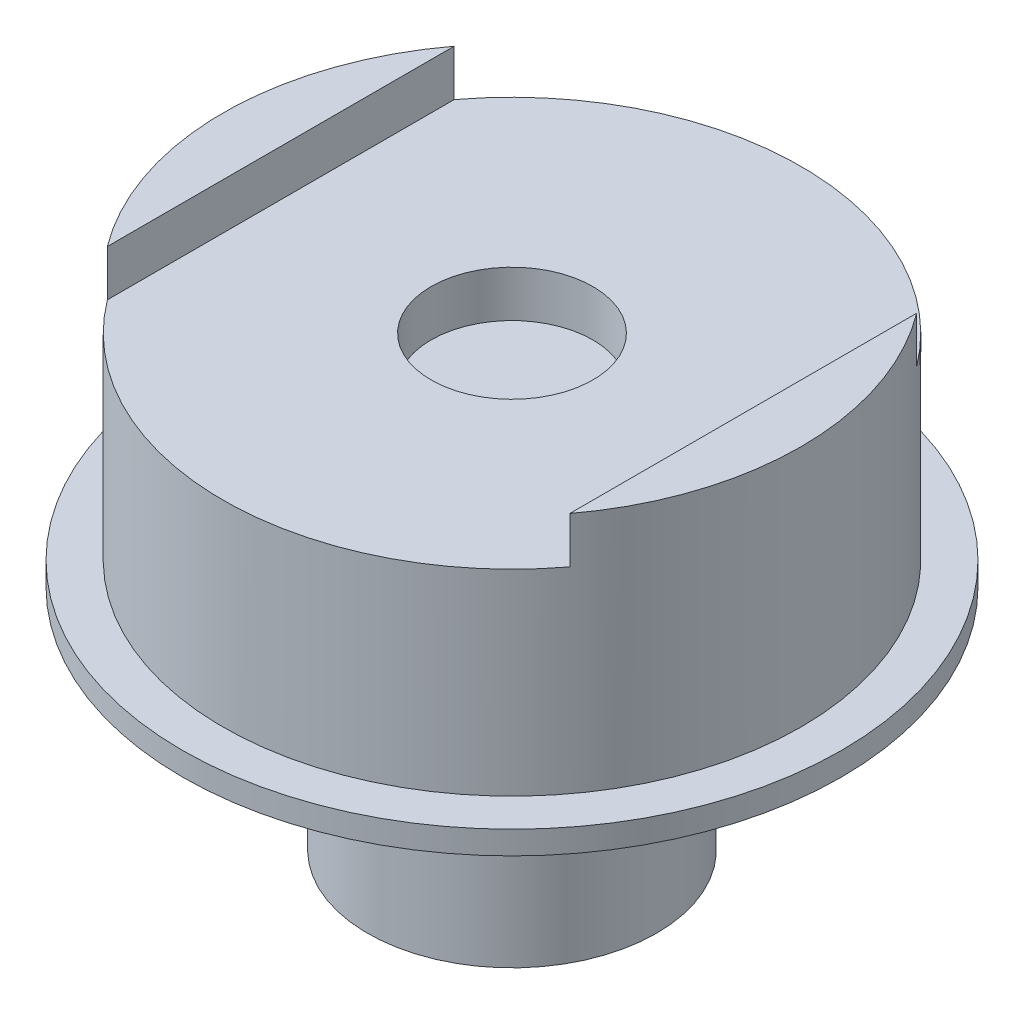
ISO-10303-21;
HEADER;
FILE_DESCRIPTION(('STEP AP214'),'2;1');
FILE_NAME('part.step','',(''),(''),'','','');
FILE_SCHEMA(('AUTOMOTIVE_DESIGN { 1 0 10303 214 1 1 1 1 }'));
ENDSEC;
DATA;
#1=APPLICATION_CONTEXT('core data for automotive mechanical design processes');
#2=APPLICATION_PROTOCOL_DEFINITION('international standard','automotive_design',2000,#1);
#3=PRODUCT_CONTEXT('',#1,'mechanical');
#4=PRODUCT('Part','Part','',(#3));
#5=PRODUCT_RELATED_PRODUCT_CATEGORY('part','',(#4));
#6=PRODUCT_DEFINITION_FORMATION('','',#4);
#7=PRODUCT_DEFINITION_CONTEXT('part definition',#1,'design');
#8=PRODUCT_DEFINITION('design','',#6,#7);
#9=PRODUCT_DEFINITION_SHAPE('','',#8);
#10=(LENGTH_UNIT() NAMED_UNIT(*) SI_UNIT(.MILLI.,.METRE.));
#11=(NAMED_UNIT(*) PLANE_ANGLE_UNIT() SI_UNIT($,.RADIAN.));
#12=(NAMED_UNIT(*) SI_UNIT($,.STERADIAN.) SOLID_ANGLE_UNIT());
#13=UNCERTAINTY_MEASURE_WITH_UNIT(LENGTH_MEASURE(1.E-05),#10,'distance_accuracy_value','');
#14=(GEOMETRIC_REPRESENTATION_CONTEXT(3) GLOBAL_UNCERTAINTY_ASSIGNED_CONTEXT((#13)) GLOBAL_UNIT_ASSIGNED_CONTEXT((#10,
#11,#12)) REPRESENTATION_CONTEXT('',''));
#15=CARTESIAN_POINT('',(0.,0.,0.));
#16=DIRECTION('',(0.,0.,1.));
#17=DIRECTION('',(1.,0.,0.));
#18=AXIS2_PLACEMENT_3D('',#15,#16,#17);
#19=CARTESIAN_POINT('',(0.,34.7,0.));
#20=DIRECTION('',(0.,1.,0.));
#21=DIRECTION('',(-1.,0.,0.));
#22=AXIS2_PLACEMENT_3D('',#19,#20,#21);
#23=PLANE('',#22);
#24=CARTESIAN_POINT('',(0.,34.7,0.));
#25=DIRECTION('',(0.,1.,0.));
#26=DIRECTION('',(-1.,0.,0.));
#27=AXIS2_PLACEMENT_3D('',#24,#25,#26);
#28=CIRCLE('',#27,7.);
#29=CARTESIAN_POINT('',(-7.,34.7,0.));
#30=VERTEX_POINT('',#29);
#31=EDGE_CURVE('E21',#30,#30,#28,.T.);
#32=ORIENTED_EDGE('',*,*,#31,.T.);
#33=EDGE_LOOP('',(#32));
#34=FACE_BOUND('',#33,.T.);
#35=ADVANCED_FACE('F18',(#34),#23,.T.);
#36=CARTESIAN_POINT('',(0.,34.7,0.));
#37=DIRECTION('',(0.,1.,0.));
#38=DIRECTION('',(-1.,0.,0.));
#39=AXIS2_PLACEMENT_3D('',#36,#37,#38);
#40=CYLINDRICAL_SURFACE('',#39,7.);
#41=CARTESIAN_POINT('',(0.,38.7,0.));
#42=DIRECTION('',(0.,1.,0.));
#43=DIRECTION('',(-1.,0.,0.));
#44=AXIS2_PLACEMENT_3D('',#41,#42,#43);
#45=CIRCLE('',#44,7.);
#46=CARTESIAN_POINT('',(-7.,38.7,0.));
#47=VERTEX_POINT('',#46);
#48=EDGE_CURVE('E75',#47,#47,#45,.F.);
#49=ORIENTED_EDGE('',*,*,#48,.F.);
#50=EDGE_LOOP('',(#49));
#51=FACE_BOUND('',#50,.T.);
#52=ORIENTED_EDGE('',*,*,#31,.F.);
#53=EDGE_LOOP('',(#52));
#54=FACE_BOUND('',#53,.T.);
#55=ADVANCED_FACE('F245',(#51,#54),#40,.F.);
#56=CARTESIAN_POINT('',(25.,42.7,0.));
#57=DIRECTION('',(0.,1.,0.));
#58=DIRECTION('',(-1.,0.,0.));
#59=AXIS2_PLACEMENT_3D('',#56,#57,#58);
#60=PLANE('',#59);
#61=CARTESIAN_POINT('',(0.,42.7,0.));
#62=DIRECTION('',(0.,-1.,0.));
#63=DIRECTION('',(1.,0.,0.));
#64=AXIS2_PLACEMENT_3D('',#61,#62,#63);
#65=CIRCLE('',#64,25.);
#66=CARTESIAN_POINT('',(-20.,42.7,15.));
#67=VERTEX_POINT('',#66);
#68=CARTESIAN_POINT('',(-20.,42.7,-15.));
#69=VERTEX_POINT('',#68);
#70=EDGE_CURVE('E61',#67,#69,#65,.T.);
#71=ORIENTED_EDGE('',*,*,#70,.F.);
#72=DIRECTION('',(0.,0.,1.));
#73=VECTOR('',#72,1.);
#74=CARTESIAN_POINT('',(-20.,42.7,-30.));
#75=LINE('',#74,#73);
#76=EDGE_CURVE('E64',#67,#69,#75,.F.);
#77=ORIENTED_EDGE('',*,*,#76,.T.);
#78=EDGE_LOOP('',(#71,#77));
#79=FACE_BOUND('',#78,.T.);
#80=ADVANCED_FACE('F63',(#79),#60,.T.);
#81=CARTESIAN_POINT('',(-20.,38.7,-30.));
#82=DIRECTION('',(-1.,0.,0.));
#83=DIRECTION('',(0.,0.,1.));
#84=AXIS2_PLACEMENT_3D('',#81,#82,#83);
#85=PLANE('',#84);
#86=ORIENTED_EDGE('',*,*,#76,.F.);
#87=DIRECTION('',(0.,-1.,0.));
#88=VECTOR('',#87,1.);
#89=CARTESIAN_POINT('',(-20.,0.,15.));
#90=LINE('',#89,#88);
#91=CARTESIAN_POINT('',(-20.,38.7,15.));
#92=VERTEX_POINT('',#91);
#93=EDGE_CURVE('E69',#92,#67,#90,.F.);
#94=ORIENTED_EDGE('',*,*,#93,.F.);
#95=DIRECTION('',(0.,0.,1.));
#96=VECTOR('',#95,1.);
#97=CARTESIAN_POINT('',(-20.,38.7,0.));
#98=LINE('',#97,#96);
#99=CARTESIAN_POINT('',(-20.,38.7,-15.));
#100=VERTEX_POINT('',#99);
#101=EDGE_CURVE('E108',#100,#92,#98,.T.);
#102=ORIENTED_EDGE('',*,*,#101,.F.);
#103=DIRECTION('',(0.,-1.,0.));
#104=VECTOR('',#103,1.);
#105=CARTESIAN_POINT('',(-20.,0.,-15.));
#106=LINE('',#105,#104);
#107=EDGE_CURVE('E68',#69,#100,#106,.T.);
#108=ORIENTED_EDGE('',*,*,#107,.F.);
#109=EDGE_LOOP('',(#86,#94,#102,#108));
#110=FACE_BOUND('',#109,.T.);
#111=ADVANCED_FACE('F73',(#110),#85,.F.);
#112=CARTESIAN_POINT('',(0.,38.7,0.));
#113=DIRECTION('',(0.,1.,0.));
#114=DIRECTION('',(-1.,0.,0.));
#115=AXIS2_PLACEMENT_3D('',#112,#113,#114);
#116=PLANE('',#115);
#117=DIRECTION('',(0.,0.,-1.));
#118=VECTOR('',#117,1.);
#119=CARTESIAN_POINT('',(20.,38.7,-30.));
#120=LINE('',#119,#118);
#121=CARTESIAN_POINT('',(20.,38.7,15.));
#122=VERTEX_POINT('',#121);
#123=CARTESIAN_POINT('',(20.,38.7,-15.));
#124=VERTEX_POINT('',#123);
#125=EDGE_CURVE('E111',#122,#124,#120,.T.);
#126=ORIENTED_EDGE('',*,*,#125,.T.);
#127=CARTESIAN_POINT('',(0.,38.7,0.));
#128=DIRECTION('',(0.,-1.,0.));
#129=DIRECTION('',(1.,0.,0.));
#130=AXIS2_PLACEMENT_3D('',#127,#128,#129);
#131=CIRCLE('',#130,25.);
#132=EDGE_CURVE('E105',#100,#124,#131,.T.);
#133=ORIENTED_EDGE('',*,*,#132,.F.);
#134=ORIENTED_EDGE('',*,*,#101,.T.);
#135=CARTESIAN_POINT('',(0.,38.7,0.));
#136=DIRECTION('',(0.,-1.,0.));
#137=DIRECTION('',(1.,0.,0.));
#138=AXIS2_PLACEMENT_3D('',#135,#136,#137);
#139=CIRCLE('',#138,25.);
#140=EDGE_CURVE('E80',#122,#92,#139,.T.);
#141=ORIENTED_EDGE('',*,*,#140,.F.);
#142=EDGE_LOOP('',(#126,#133,#134,#141));
#143=FACE_BOUND('',#142,.T.);
#144=ORIENTED_EDGE('',*,*,#48,.T.);
#145=EDGE_LOOP('',(#144));
#146=FACE_BOUND('',#145,.T.);
#147=ADVANCED_FACE('F118',(#143,#146),#116,.T.);
#148=CARTESIAN_POINT('',(20.,38.7,-30.));
#149=DIRECTION('',(1.,0.,0.));
#150=DIRECTION('',(0.,0.,-1.));
#151=AXIS2_PLACEMENT_3D('',#148,#149,#150);
#152=PLANE('',#151);
#153=DIRECTION('',(0.,0.,1.));
#154=VECTOR('',#153,1.);
#155=CARTESIAN_POINT('',(20.,42.7,0.));
#156=LINE('',#155,#154);
#157=CARTESIAN_POINT('',(20.,42.7,-15.));
#158=VERTEX_POINT('',#157);
#159=CARTESIAN_POINT('',(20.,42.7,15.));
#160=VERTEX_POINT('',#159);
#161=EDGE_CURVE('E36',#158,#160,#156,.T.);
#162=ORIENTED_EDGE('',*,*,#161,.F.);
#163=DIRECTION('',(0.,-1.,0.));
#164=VECTOR('',#163,1.);
#165=CARTESIAN_POINT('',(20.,0.,-15.));
#166=LINE('',#165,#164);
#167=EDGE_CURVE('E104',#124,#158,#166,.F.);
#168=ORIENTED_EDGE('',*,*,#167,.F.);
#169=ORIENTED_EDGE('',*,*,#125,.F.);
#170=DIRECTION('',(0.,-1.,0.));
#171=VECTOR('',#170,1.);
#172=CARTESIAN_POINT('',(20.,0.,15.));
#173=LINE('',#172,#171);
#174=EDGE_CURVE('E82',#160,#122,#173,.T.);
#175=ORIENTED_EDGE('',*,*,#174,.F.);
#176=EDGE_LOOP('',(#162,#168,#169,#175));
#177=FACE_BOUND('',#176,.T.);
#178=ADVANCED_FACE('F119',(#177),#152,.F.);
#179=CARTESIAN_POINT('',(25.,42.7,0.));
#180=DIRECTION('',(0.,1.,0.));
#181=DIRECTION('',(-1.,0.,0.));
#182=AXIS2_PLACEMENT_3D('',#179,#180,#181);
#183=PLANE('',#182);
#184=ORIENTED_EDGE('',*,*,#161,.T.);
#185=CARTESIAN_POINT('',(0.,42.7,0.));
#186=DIRECTION('',(0.,-1.,0.));
#187=DIRECTION('',(1.,0.,0.));
#188=AXIS2_PLACEMENT_3D('',#185,#186,#187);
#189=CIRCLE('',#188,25.);
#190=EDGE_CURVE('E57',#158,#160,#189,.T.);
#191=ORIENTED_EDGE('',*,*,#190,.F.);
#192=EDGE_LOOP('',(#184,#191));
#193=FACE_BOUND('',#192,.T.);
#194=ADVANCED_FACE('F122',(#193),#183,.T.);
#195=CARTESIAN_POINT('',(0.,24.,0.));
#196=DIRECTION('',(0.,-1.,0.));
#197=DIRECTION('',(1.,0.,0.));
#198=AXIS2_PLACEMENT_3D('',#195,#196,#197);
#199=PLANE('',#198);
#200=CARTESIAN_POINT('',(0.,24.,0.));
#201=DIRECTION('',(0.,-1.,0.));
#202=DIRECTION('',(1.,0.,0.));
#203=AXIS2_PLACEMENT_3D('',#200,#201,#202);
#204=CIRCLE('',#203,8.);
#205=CARTESIAN_POINT('',(8.,24.,0.));
#206=VERTEX_POINT('',#205);
#207=EDGE_CURVE('E100',#206,#206,#204,.T.);
#208=ORIENTED_EDGE('',*,*,#207,.T.);
#209=EDGE_LOOP('',(#208));
#210=FACE_BOUND('',#209,.T.);
#211=ADVANCED_FACE('F124',(#210),#199,.T.);
#212=CARTESIAN_POINT('',(0.,0.,0.));
#213=DIRECTION('',(0.,-1.,0.));
#214=DIRECTION('',(1.,0.,0.));
#215=AXIS2_PLACEMENT_3D('',#212,#213,#214);
#216=CYLINDRICAL_SURFACE('',#215,25.);
#217=ORIENTED_EDGE('',*,*,#93,.T.);
#218=ORIENTED_EDGE('',*,*,#70,.T.);
#219=ORIENTED_EDGE('',*,*,#107,.T.);
#220=ORIENTED_EDGE('',*,*,#132,.T.);
#221=ORIENTED_EDGE('',*,*,#167,.T.);
#222=ORIENTED_EDGE('',*,*,#190,.T.);
#223=ORIENTED_EDGE('',*,*,#174,.T.);
#224=ORIENTED_EDGE('',*,*,#140,.T.);
#225=EDGE_LOOP('',(#217,#218,#219,#220,#221,#222,#223,#224));
#226=FACE_BOUND('',#225,.T.);
#227=CARTESIAN_POINT('',(0.,21.7,0.));
#228=DIRECTION('',(0.,-1.,0.));
#229=DIRECTION('',(1.,0.,0.));
#230=AXIS2_PLACEMENT_3D('',#227,#228,#229);
#231=CIRCLE('',#230,25.);
#232=CARTESIAN_POINT('',(25.,21.7,0.));
#233=VERTEX_POINT('',#232);
#234=EDGE_CURVE('E97',#233,#233,#231,.T.);
#235=ORIENTED_EDGE('',*,*,#234,.F.);
#236=EDGE_LOOP('',(#235));
#237=FACE_BOUND('',#236,.T.);
#238=ADVANCED_FACE('F77',(#226,#237),#216,.T.);
#239=CARTESIAN_POINT('',(0.,0.,0.));
#240=DIRECTION('',(0.,-1.,0.));
#241=DIRECTION('',(1.,0.,0.));
#242=AXIS2_PLACEMENT_3D('',#239,#240,#241);
#243=CYLINDRICAL_SURFACE('',#242,8.);
#244=CARTESIAN_POINT('',(0.,0.,0.));
#245=DIRECTION('',(0.,-1.,0.));
#246=DIRECTION('',(1.,0.,0.));
#247=AXIS2_PLACEMENT_3D('',#244,#245,#246);
#248=CIRCLE('',#247,8.);
#249=CARTESIAN_POINT('',(8.,0.,0.));
#250=VERTEX_POINT('',#249);
#251=EDGE_CURVE('E94',#250,#250,#248,.F.);
#252=ORIENTED_EDGE('',*,*,#251,.F.);
#253=EDGE_LOOP('',(#252));
#254=FACE_BOUND('',#253,.T.);
#255=ORIENTED_EDGE('',*,*,#207,.F.);
#256=EDGE_LOOP('',(#255));
#257=FACE_BOUND('',#256,.T.);
#258=ADVANCED_FACE('F157',(#254,#257),#243,.F.);
#259=CARTESIAN_POINT('',(28.5,21.7,0.));
#260=DIRECTION('',(0.,1.,0.));
#261=DIRECTION('',(-1.,0.,0.));
#262=AXIS2_PLACEMENT_3D('',#259,#260,#261);
#263=PLANE('',#262);
#264=CARTESIAN_POINT('',(0.,21.7,0.));
#265=DIRECTION('',(0.,-1.,0.));
#266=DIRECTION('',(1.,0.,0.));
#267=AXIS2_PLACEMENT_3D('',#264,#265,#266);
#268=CIRCLE('',#267,28.5);
#269=CARTESIAN_POINT('',(28.5,21.7,0.));
#270=VERTEX_POINT('',#269);
#271=EDGE_CURVE('E91',#270,#270,#268,.T.);
#272=ORIENTED_EDGE('',*,*,#271,.F.);
#273=EDGE_LOOP('',(#272));
#274=FACE_BOUND('',#273,.T.);
#275=ORIENTED_EDGE('',*,*,#234,.T.);
#276=EDGE_LOOP('',(#275));
#277=FACE_BOUND('',#276,.T.);
#278=ADVANCED_FACE('F153',(#274,#277),#263,.T.);
#279=CARTESIAN_POINT('',(8.,0.,0.));
#280=DIRECTION('',(0.,-1.,0.));
#281=DIRECTION('',(1.,0.,0.));
#282=AXIS2_PLACEMENT_3D('',#279,#280,#281);
#283=PLANE('',#282);
#284=ORIENTED_EDGE('',*,*,#251,.T.);
#285=EDGE_LOOP('',(#284));
#286=FACE_BOUND('',#285,.T.);
#287=CARTESIAN_POINT('',(0.,0.,0.));
#288=DIRECTION('',(0.,-1.,0.));
#289=DIRECTION('',(1.,0.,0.));
#290=AXIS2_PLACEMENT_3D('',#287,#288,#289);
#291=CIRCLE('',#290,12.5);
#292=CARTESIAN_POINT('',(12.5,0.,0.));
#293=VERTEX_POINT('',#292);
#294=EDGE_CURVE('E88',#293,#293,#291,.F.);
#295=ORIENTED_EDGE('',*,*,#294,.F.);
#296=EDGE_LOOP('',(#295));
#297=FACE_BOUND('',#296,.T.);
#298=ADVANCED_FACE('F149',(#286,#297),#283,.T.);
#299=CARTESIAN_POINT('',(0.,0.,0.));
#300=DIRECTION('',(0.,-1.,0.));
#301=DIRECTION('',(1.,0.,0.));
#302=AXIS2_PLACEMENT_3D('',#299,#300,#301);
#303=CYLINDRICAL_SURFACE('',#302,28.5);
#304=ORIENTED_EDGE('',*,*,#271,.T.);
#305=EDGE_LOOP('',(#304));
#306=FACE_BOUND('',#305,.T.);
#307=CARTESIAN_POINT('',(0.,19.7,0.));
#308=DIRECTION('',(0.,-1.,0.));
#309=DIRECTION('',(1.,0.,0.));
#310=AXIS2_PLACEMENT_3D('',#307,#308,#309);
#311=CIRCLE('',#310,28.5);
#312=CARTESIAN_POINT('',(28.5,19.7,0.));
#313=VERTEX_POINT('',#312);
#314=EDGE_CURVE('E27',#313,#313,#311,.T.);
#315=ORIENTED_EDGE('',*,*,#314,.F.);
#316=EDGE_LOOP('',(#315));
#317=FACE_BOUND('',#316,.T.);
#318=ADVANCED_FACE('F142',(#306,#317),#303,.T.);
#319=CARTESIAN_POINT('',(0.,0.,0.));
#320=DIRECTION('',(0.,-1.,0.));
#321=DIRECTION('',(1.,0.,0.));
#322=AXIS2_PLACEMENT_3D('',#319,#320,#321);
#323=CYLINDRICAL_SURFACE('',#322,12.5);
#324=CARTESIAN_POINT('',(0.,19.7,0.));
#325=DIRECTION('',(0.,-1.,0.));
#326=DIRECTION('',(1.,0.,0.));
#327=AXIS2_PLACEMENT_3D('',#324,#325,#326);
#328=CIRCLE('',#327,12.5);
#329=CARTESIAN_POINT('',(12.5,19.7,0.));
#330=VERTEX_POINT('',#329);
#331=EDGE_CURVE('E11',#330,#330,#328,.F.);
#332=ORIENTED_EDGE('',*,*,#331,.F.);
#333=EDGE_LOOP('',(#332));
#334=FACE_BOUND('',#333,.T.);
#335=ORIENTED_EDGE('',*,*,#294,.T.);
#336=EDGE_LOOP('',(#335));
#337=FACE_BOUND('',#336,.T.);
#338=ADVANCED_FACE('F136',(#334,#337),#323,.T.);
#339=CARTESIAN_POINT('',(12.5,19.7,0.));
#340=DIRECTION('',(0.,-1.,0.));
#341=DIRECTION('',(1.,0.,0.));
#342=AXIS2_PLACEMENT_3D('',#339,#340,#341);
#343=PLANE('',#342);
#344=ORIENTED_EDGE('',*,*,#331,.T.);
#345=EDGE_LOOP('',(#344));
#346=FACE_BOUND('',#345,.T.);
#347=ORIENTED_EDGE('',*,*,#314,.T.);
#348=EDGE_LOOP('',(#347));
#349=FACE_BOUND('',#348,.T.);
#350=ADVANCED_FACE('F134',(#346,#349),#343,.T.);
#351=CLOSED_SHELL('',(#35,#55,#80,#111,#147,#178,#194,#211,#238,#258,#278,#298,#318,#338,#350));
#352=MANIFOLD_SOLID_BREP('B1',#351);
#353=ADVANCED_BREP_SHAPE_REPRESENTATION('',(#18,#352),#14);
#354=SHAPE_DEFINITION_REPRESENTATION(#9,#353);
ENDSEC;
END-ISO-10303-21;
